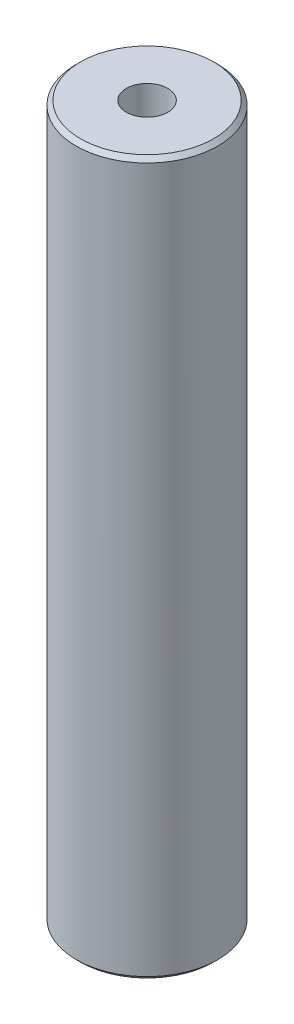
ISO-10303-21;
HEADER;
FILE_DESCRIPTION(('STEP AP214'),'2;1');
FILE_NAME('part.step','',(''),(''),'','','');
FILE_SCHEMA(('AUTOMOTIVE_DESIGN { 1 0 10303 214 1 1 1 1 }'));
ENDSEC;
DATA;
#1=APPLICATION_CONTEXT('core data for automotive mechanical design processes');
#2=APPLICATION_PROTOCOL_DEFINITION('international standard','automotive_design',2000,#1);
#3=PRODUCT_CONTEXT('',#1,'mechanical');
#4=PRODUCT('Part','Part','',(#3));
#5=PRODUCT_RELATED_PRODUCT_CATEGORY('part','',(#4));
#6=PRODUCT_DEFINITION_FORMATION('','',#4);
#7=PRODUCT_DEFINITION_CONTEXT('part definition',#1,'design');
#8=PRODUCT_DEFINITION('design','',#6,#7);
#9=PRODUCT_DEFINITION_SHAPE('','',#8);
#10=(LENGTH_UNIT() NAMED_UNIT(*) SI_UNIT(.MILLI.,.METRE.));
#11=(NAMED_UNIT(*) PLANE_ANGLE_UNIT() SI_UNIT($,.RADIAN.));
#12=(NAMED_UNIT(*) SI_UNIT($,.STERADIAN.) SOLID_ANGLE_UNIT());
#13=UNCERTAINTY_MEASURE_WITH_UNIT(LENGTH_MEASURE(1.E-05),#10,'distance_accuracy_value','');
#14=(GEOMETRIC_REPRESENTATION_CONTEXT(3) GLOBAL_UNCERTAINTY_ASSIGNED_CONTEXT((#13)) GLOBAL_UNIT_ASSIGNED_CONTEXT((#10,
#11,#12)) REPRESENTATION_CONTEXT('',''));
#15=CARTESIAN_POINT('',(0.,0.,0.));
#16=DIRECTION('',(0.,0.,1.));
#17=DIRECTION('',(1.,0.,0.));
#18=AXIS2_PLACEMENT_3D('',#15,#16,#17);
#19=CARTESIAN_POINT('',(0.,176.149081972679,0.));
#20=DIRECTION('',(0.,-1.,0.));
#21=DIRECTION('',(0.,0.,-1.));
#22=AXIS2_PLACEMENT_3D('',#19,#20,#21);
#23=CYLINDRICAL_SURFACE('',#22,17.5);
#24=CARTESIAN_POINT('',(0.,175.102440835833,0.));
#25=DIRECTION('',(0.,1.,0.));
#26=DIRECTION('',(0.,0.,1.));
#27=AXIS2_PLACEMENT_3D('',#24,#25,#26);
#28=CIRCLE('',#27,17.5);
#29=CARTESIAN_POINT('',(0.,175.102440835833,-17.5));
#30=VERTEX_POINT('',#29);
#31=EDGE_CURVE('E50',#30,#30,#28,.F.);
#32=ORIENTED_EDGE('',*,*,#31,.T.);
#33=EDGE_LOOP('',(#32));
#34=FACE_BOUND('',#33,.T.);
#35=CARTESIAN_POINT('',(0.,1.04664113684588,0.));
#36=DIRECTION('',(0.,1.,0.));
#37=DIRECTION('',(0.,0.,1.));
#38=AXIS2_PLACEMENT_3D('',#35,#36,#37);
#39=CIRCLE('',#38,17.5);
#40=CARTESIAN_POINT('',(0.,1.04664113684588,17.5));
#41=VERTEX_POINT('',#40);
#42=EDGE_CURVE('E51',#41,#41,#39,.T.);
#43=ORIENTED_EDGE('',*,*,#42,.T.);
#44=EDGE_LOOP('',(#43));
#45=FACE_BOUND('',#44,.T.);
#46=ADVANCED_FACE('F39',(#34,#45),#23,.T.);
#47=CARTESIAN_POINT('',(0.,176.149081972679,0.));
#48=DIRECTION('',(0.,1.,0.));
#49=DIRECTION('',(0.,0.,1.));
#50=AXIS2_PLACEMENT_3D('',#47,#48,#49);
#51=PLANE('',#50);
#52=CARTESIAN_POINT('',(0.,176.149081972679,0.));
#53=DIRECTION('',(0.,1.,0.));
#54=DIRECTION('',(0.,0.,1.));
#55=AXIS2_PLACEMENT_3D('',#52,#53,#54);
#56=CIRCLE('',#55,16.4533588631541);
#57=CARTESIAN_POINT('',(0.,176.149081972679,-16.4533588631541));
#58=VERTEX_POINT('',#57);
#59=EDGE_CURVE('E54',#58,#58,#56,.T.);
#60=ORIENTED_EDGE('',*,*,#59,.T.);
#61=EDGE_LOOP('',(#60));
#62=FACE_BOUND('',#61,.T.);
#63=CARTESIAN_POINT('',(0.,176.149081972679,0.));
#64=DIRECTION('',(0.,1.,0.));
#65=DIRECTION('',(0.,0.,1.));
#66=AXIS2_PLACEMENT_3D('',#63,#64,#65);
#67=CIRCLE('',#66,5.11764709144424);
#68=CARTESIAN_POINT('',(0.,176.149081972679,5.11764709144424));
#69=VERTEX_POINT('',#68);
#70=EDGE_CURVE('E58',#69,#69,#67,.T.);
#71=ORIENTED_EDGE('',*,*,#70,.F.);
#72=EDGE_LOOP('',(#71));
#73=FACE_BOUND('',#72,.T.);
#74=ADVANCED_FACE('F69',(#62,#73),#51,.T.);
#75=CARTESIAN_POINT('',(0.,0.,0.));
#76=DIRECTION('',(0.,1.,0.));
#77=DIRECTION('',(0.,0.,1.));
#78=AXIS2_PLACEMENT_3D('',#75,#76,#77);
#79=PLANE('',#78);
#80=CARTESIAN_POINT('',(0.,0.,0.));
#81=DIRECTION('',(0.,1.,0.));
#82=DIRECTION('',(0.,0.,1.));
#83=AXIS2_PLACEMENT_3D('',#80,#81,#82);
#84=CIRCLE('',#83,16.4533588631541);
#85=CARTESIAN_POINT('',(0.,0.,16.4533588631541));
#86=VERTEX_POINT('',#85);
#87=EDGE_CURVE('E10',#86,#86,#84,.F.);
#88=ORIENTED_EDGE('',*,*,#87,.T.);
#89=EDGE_LOOP('',(#88));
#90=FACE_BOUND('',#89,.T.);
#91=CARTESIAN_POINT('',(0.,0.,0.));
#92=DIRECTION('',(0.,1.,0.));
#93=DIRECTION('',(0.,0.,1.));
#94=AXIS2_PLACEMENT_3D('',#91,#92,#93);
#95=CIRCLE('',#94,5.11764709144424);
#96=CARTESIAN_POINT('',(0.,0.,5.11764709144424));
#97=VERTEX_POINT('',#96);
#98=EDGE_CURVE('E63',#97,#97,#95,.T.);
#99=ORIENTED_EDGE('',*,*,#98,.T.);
#100=EDGE_LOOP('',(#99));
#101=FACE_BOUND('',#100,.T.);
#102=ADVANCED_FACE('F75',(#90,#101),#79,.F.);
#103=CARTESIAN_POINT('',(0.,176.149081972679,0.));
#104=DIRECTION('',(0.,-1.,0.));
#105=DIRECTION('',(0.,0.,-1.));
#106=AXIS2_PLACEMENT_3D('',#103,#104,#105);
#107=CYLINDRICAL_SURFACE('',#106,5.11764709144424);
#108=ORIENTED_EDGE('',*,*,#70,.T.);
#109=EDGE_LOOP('',(#108));
#110=FACE_BOUND('',#109,.T.);
#111=ORIENTED_EDGE('',*,*,#98,.F.);
#112=EDGE_LOOP('',(#111));
#113=FACE_BOUND('',#112,.T.);
#114=ADVANCED_FACE('F70',(#110,#113),#107,.F.);
#115=CARTESIAN_POINT('',(0.,176.149081972679,0.));
#116=DIRECTION('',(0.,-1.,0.));
#117=DIRECTION('',(0.,0.,-1.));
#118=AXIS2_PLACEMENT_3D('',#115,#116,#117);
#119=CONICAL_SURFACE('',#118,16.4533588631541,0.785398163397443);
#120=CARTESIAN_POINT('',(0.,175.102440835833,-17.5));
#121=CARTESIAN_POINT('',(0.,175.113343347675,-17.4890974881579));
#122=CARTESIAN_POINT('',(0.,175.124245859517,-17.4781949763157));
#123=CARTESIAN_POINT('',(0.,175.146050883202,-17.4563899526314));
#124=CARTESIAN_POINT('',(0.,175.156953395044,-17.4454874407893));
#125=CARTESIAN_POINT('',(0.,175.178758418728,-17.423682417105));
#126=CARTESIAN_POINT('',(0.,175.18966093057,-17.4127799052629));
#127=CARTESIAN_POINT('',(0.,175.211465954255,-17.3909748815786));
#128=CARTESIAN_POINT('',(0.,175.222368466097,-17.3800723697364));
#129=CARTESIAN_POINT('',(0.,175.244173489781,-17.3582673460521));
#130=CARTESIAN_POINT('',(0.,175.255076001623,-17.34736483421));
#131=CARTESIAN_POINT('',(0.,175.276881025307,-17.3255598105257));
#132=CARTESIAN_POINT('',(0.,175.28778353715,-17.3146572986835));
#133=CARTESIAN_POINT('',(0.,175.309588560834,-17.2928522749993));
#134=CARTESIAN_POINT('',(0.,175.320491072676,-17.2819497631571));
#135=CARTESIAN_POINT('',(0.,175.34229609636,-17.2601447394728));
#136=CARTESIAN_POINT('',(0.,175.353198608202,-17.2492422276307));
#137=CARTESIAN_POINT('',(0.,175.375003631887,-17.2274372039464));
#138=CARTESIAN_POINT('',(0.,175.385906143729,-17.2165346921043));
#139=CARTESIAN_POINT('',(0.,175.407711167413,-17.19472966842));
#140=CARTESIAN_POINT('',(0.,175.418613679255,-17.1838271565778));
#141=CARTESIAN_POINT('',(0.,175.44041870294,-17.1620221328935));
#142=CARTESIAN_POINT('',(0.,175.451321214782,-17.1511196210514));
#143=CARTESIAN_POINT('',(0.,175.473126238466,-17.1293145973671));
#144=CARTESIAN_POINT('',(0.,175.484028750308,-17.1184120855249));
#145=CARTESIAN_POINT('',(0.,175.505833773993,-17.0966070618406));
#146=CARTESIAN_POINT('',(0.,175.516736285835,-17.0857045499985));
#147=CARTESIAN_POINT('',(0.,175.538541309519,-17.0638995263142));
#148=CARTESIAN_POINT('',(0.,175.549443821361,-17.0529970144721));
#149=CARTESIAN_POINT('',(0.,175.571248845045,-17.0311919907878));
#150=CARTESIAN_POINT('',(0.,175.582151356888,-17.0202894789456));
#151=CARTESIAN_POINT('',(0.,175.603956380572,-16.9984844552613));
#152=CARTESIAN_POINT('',(0.,175.614858892414,-16.9875819434192));
#153=CARTESIAN_POINT('',(0.,175.636663916098,-16.9657769197349));
#154=CARTESIAN_POINT('',(0.,175.64756642794,-16.9548744078928));
#155=CARTESIAN_POINT('',(0.,175.669371451625,-16.9330693842085));
#156=CARTESIAN_POINT('',(0.,175.680273963467,-16.9221668723663));
#157=CARTESIAN_POINT('',(0.,175.702078987151,-16.900361848682));
#158=CARTESIAN_POINT('',(0.,175.712981498993,-16.8894593368399));
#159=CARTESIAN_POINT('',(0.,175.734786522678,-16.8676543131556));
#160=CARTESIAN_POINT('',(0.,175.74568903452,-16.8567518013135));
#161=CARTESIAN_POINT('',(0.,175.767494058204,-16.8349467776292));
#162=CARTESIAN_POINT('',(0.,175.778396570046,-16.824044265787));
#163=CARTESIAN_POINT('',(0.,175.80020159373,-16.8022392421027));
#164=CARTESIAN_POINT('',(0.,175.811104105573,-16.7913367302606));
#165=CARTESIAN_POINT('',(0.,175.832909129257,-16.7695317065763));
#166=CARTESIAN_POINT('',(0.,175.843811641099,-16.7586291947342));
#167=CARTESIAN_POINT('',(0.,175.865616664783,-16.7368241710499));
#168=CARTESIAN_POINT('',(0.,175.876519176625,-16.7259216592077));
#169=CARTESIAN_POINT('',(0.,175.89832420031,-16.7041166355234));
#170=CARTESIAN_POINT('',(0.,175.909226712152,-16.6932141236813));
#171=CARTESIAN_POINT('',(0.,175.931031735836,-16.671409099997));
#172=CARTESIAN_POINT('',(0.,175.941934247678,-16.6605065881548));
#173=CARTESIAN_POINT('',(0.,175.963739271363,-16.6387015644706));
#174=CARTESIAN_POINT('',(0.,175.974641783205,-16.6277990526284));
#175=CARTESIAN_POINT('',(0.,175.996446806889,-16.6059940289441));
#176=CARTESIAN_POINT('',(0.,176.007349318731,-16.595091517102));
#177=CARTESIAN_POINT('',(0.,176.029154342415,-16.5732864934177));
#178=CARTESIAN_POINT('',(0.,176.040056854258,-16.5623839815755));
#179=CARTESIAN_POINT('',(0.,176.061861877942,-16.5405789578912));
#180=CARTESIAN_POINT('',(0.,176.072764389784,-16.5296764460491));
#181=CARTESIAN_POINT('',(0.,176.094569413468,-16.5078714223648));
#182=CARTESIAN_POINT('',(0.,176.10547192531,-16.4969689105227));
#183=CARTESIAN_POINT('',(0.,176.127276948995,-16.4751638868384));
#184=CARTESIAN_POINT('',(0.,176.138179460837,-16.4642613749962));
#185=CARTESIAN_POINT('',(0.,176.149081972679,-16.4533588631541));
#186=B_SPLINE_CURVE_WITH_KNOTS('',3,(#120,#121,#122,#123,#124,#125,#126,#127,#128,#129,#130,
#131,#132,#133,#134,#135,#136,#137,#138,#139,#140,#141,#142,#143,#144,#145,#146,#147,#148,#149,
#150,#151,#152,#153,#154,#155,#156,#157,#158,#159,#160,#161,#162,#163,#164,#165,#166,#167,#168,
#169,#170,#171,#172,#173,#174,#175,#176,#177,#178,#179,#180,#181,#182,#183,#184,#185),
.UNSPECIFIED.,.F.,.F.,(4,2,2,2,2,2,2,2,2,2,2,2,2,2,2,2,2,2,2,2,2,2,2,2,2,2,2,2,2,2,2,2,4),(0.,
0.0462554403332948,0.09251088066657,0.138766320999865,0.185021761333138,0.231277201666432,
0.277532641999708,0.323788082333002,0.370043522666278,0.416298962999573,0.462554403332848,
0.508809843666143,0.555065283999418,0.601320724332713,0.647576164665988,0.693831604999283,
0.740087045332555,0.78634248566585,0.832597925999125,0.87885336633242,0.925108806665695,
0.97136424699899,1.01761968733227,1.06387512766556,1.11013056799884,1.15638600833213,
1.20264144866541,1.2488968889987,1.29515232933199,1.34140776966527,1.38766320999856,
1.43391865033184,1.48017409066513),.UNSPECIFIED.);
#187=EDGE_CURVE('BSEAM81',#30,#58,#186,.T.);
#188=ORIENTED_EDGE('',*,*,#31,.F.);
#189=ORIENTED_EDGE('',*,*,#59,.F.);
#190=ORIENTED_EDGE('',*,*,#187,.T.);
#191=ORIENTED_EDGE('',*,*,#187,.F.);
#192=EDGE_LOOP('',(#188,#190,#189,#191));
#193=FACE_BOUND('',#192,.T.);
#194=ADVANCED_FACE('F81',(#193),#119,.T.);
#195=CARTESIAN_POINT('',(0.,1.04664113684588,0.));
#196=DIRECTION('',(0.,1.,0.));
#197=DIRECTION('',(0.,0.,1.));
#198=AXIS2_PLACEMENT_3D('',#195,#196,#197);
#199=CONICAL_SURFACE('',#198,17.5,0.785398163397463);
#200=ORIENTED_EDGE('',*,*,#87,.F.);
#201=EDGE_LOOP('',(#200));
#202=FACE_BOUND('',#201,.T.);
#203=ORIENTED_EDGE('',*,*,#42,.F.);
#204=EDGE_LOOP('',(#203));
#205=FACE_BOUND('',#204,.T.);
#206=ADVANCED_FACE('F45',(#202,#205),#199,.T.);
#207=CLOSED_SHELL('',(#46,#74,#102,#114,#194,#206));
#208=MANIFOLD_SOLID_BREP('B2',#207);
#209=ADVANCED_BREP_SHAPE_REPRESENTATION('',(#18,#208),#14);
#210=SHAPE_DEFINITION_REPRESENTATION(#9,#209);
ENDSEC;
END-ISO-10303-21;
